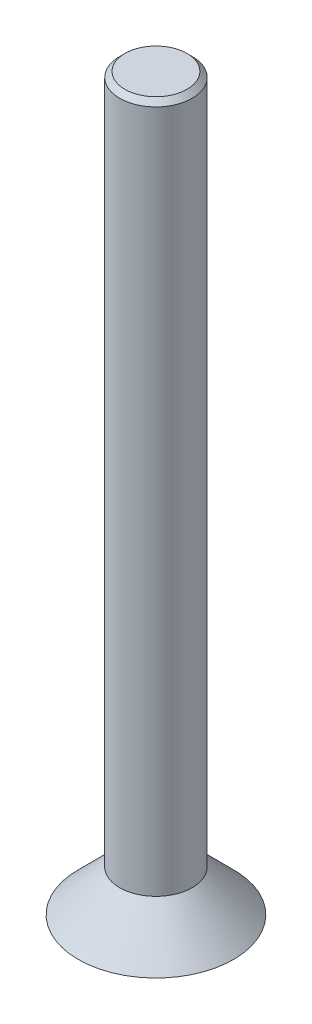
ISO-10303-21;
HEADER;
FILE_DESCRIPTION(('STEP AP214'),'2;1');
FILE_NAME('part.step','',(''),(''),'','','');
FILE_SCHEMA(('AUTOMOTIVE_DESIGN { 1 0 10303 214 1 1 1 1 }'));
ENDSEC;
DATA;
#1=APPLICATION_CONTEXT('core data for automotive mechanical design processes');
#2=APPLICATION_PROTOCOL_DEFINITION('international standard','automotive_design',2000,#1);
#3=PRODUCT_CONTEXT('',#1,'mechanical');
#4=PRODUCT('Part','Part','',(#3));
#5=PRODUCT_RELATED_PRODUCT_CATEGORY('part','',(#4));
#6=PRODUCT_DEFINITION_FORMATION('','',#4);
#7=PRODUCT_DEFINITION_CONTEXT('part definition',#1,'design');
#8=PRODUCT_DEFINITION('design','',#6,#7);
#9=PRODUCT_DEFINITION_SHAPE('','',#8);
#10=(LENGTH_UNIT() NAMED_UNIT(*) SI_UNIT(.MILLI.,.METRE.));
#11=(NAMED_UNIT(*) PLANE_ANGLE_UNIT() SI_UNIT($,.RADIAN.));
#12=(NAMED_UNIT(*) SI_UNIT($,.STERADIAN.) SOLID_ANGLE_UNIT());
#13=UNCERTAINTY_MEASURE_WITH_UNIT(LENGTH_MEASURE(1.E-05),#10,'distance_accuracy_value','');
#14=(GEOMETRIC_REPRESENTATION_CONTEXT(3) GLOBAL_UNCERTAINTY_ASSIGNED_CONTEXT((#13)) GLOBAL_UNIT_ASSIGNED_CONTEXT((#10,
#11,#12)) REPRESENTATION_CONTEXT('',''));
#15=CARTESIAN_POINT('',(0.,0.,0.));
#16=DIRECTION('',(0.,0.,1.));
#17=DIRECTION('',(1.,0.,0.));
#18=AXIS2_PLACEMENT_3D('',#15,#16,#17);
#19=CARTESIAN_POINT('',(0.,0.,0.));
#20=DIRECTION('',(0.,1.,0.));
#21=DIRECTION('',(0.,0.,1.));
#22=AXIS2_PLACEMENT_3D('',#19,#20,#21);
#23=PLANE('',#22);
#24=CARTESIAN_POINT('',(0.,0.,0.));
#25=DIRECTION('',(0.,1.,0.));
#26=DIRECTION('',(0.,0.,1.));
#27=AXIS2_PLACEMENT_3D('',#24,#25,#26);
#28=CIRCLE('',#27,3.);
#29=CARTESIAN_POINT('',(0.,0.,3.));
#30=VERTEX_POINT('',#29);
#31=EDGE_CURVE('E128',#30,#30,#28,.T.);
#32=ORIENTED_EDGE('',*,*,#31,.F.);
#33=EDGE_LOOP('',(#32));
#34=FACE_BOUND('',#33,.T.);
#35=DIRECTION('',(0.866025403784439,0.,0.5));
#36=VECTOR('',#35,1.);
#37=CARTESIAN_POINT('',(-1.,0.,0.577350269189626));
#38=LINE('',#37,#36);
#39=CARTESIAN_POINT('',(-1.,0.,0.577350269189626));
#40=VERTEX_POINT('',#39);
#41=CARTESIAN_POINT('',(0.,0.,1.15470053837925));
#42=VERTEX_POINT('',#41);
#43=EDGE_CURVE('E57',#40,#42,#38,.T.);
#44=ORIENTED_EDGE('',*,*,#43,.T.);
#45=DIRECTION('',(0.866025403784438,0.,-0.5));
#46=VECTOR('',#45,1.);
#47=CARTESIAN_POINT('',(0.,0.,1.15470053837925));
#48=LINE('',#47,#46);
#49=CARTESIAN_POINT('',(1.,0.,0.577350269189626));
#50=VERTEX_POINT('',#49);
#51=EDGE_CURVE('E113',#42,#50,#48,.T.);
#52=ORIENTED_EDGE('',*,*,#51,.T.);
#53=DIRECTION('',(0.,0.,-1.));
#54=VECTOR('',#53,1.);
#55=CARTESIAN_POINT('',(1.,0.,0.577350269189626));
#56=LINE('',#55,#54);
#57=CARTESIAN_POINT('',(0.999999999999999,0.,-0.577350269189626));
#58=VERTEX_POINT('',#57);
#59=EDGE_CURVE('E111',#50,#58,#56,.T.);
#60=ORIENTED_EDGE('',*,*,#59,.T.);
#61=DIRECTION('',(-0.866025403784439,0.,-0.5));
#62=VECTOR('',#61,1.);
#63=CARTESIAN_POINT('',(0.999999999999999,0.,-0.577350269189626));
#64=LINE('',#63,#62);
#65=CARTESIAN_POINT('',(0.,0.,-1.15470053837925));
#66=VERTEX_POINT('',#65);
#67=EDGE_CURVE('E92',#58,#66,#64,.T.);
#68=ORIENTED_EDGE('',*,*,#67,.T.);
#69=DIRECTION('',(-0.866025403784438,0.,0.5));
#70=VECTOR('',#69,1.);
#71=CARTESIAN_POINT('',(0.,0.,-1.15470053837925));
#72=LINE('',#71,#70);
#73=CARTESIAN_POINT('',(-1.,0.,-0.577350269189625));
#74=VERTEX_POINT('',#73);
#75=EDGE_CURVE('E101',#66,#74,#72,.T.);
#76=ORIENTED_EDGE('',*,*,#75,.T.);
#77=DIRECTION('',(0.,0.,1.));
#78=VECTOR('',#77,1.);
#79=CARTESIAN_POINT('',(-1.,0.,-0.577350269189625));
#80=LINE('',#79,#78);
#81=EDGE_CURVE('E107',#74,#40,#80,.T.);
#82=ORIENTED_EDGE('',*,*,#81,.T.);
#83=EDGE_LOOP('',(#44,#52,#60,#68,#76,#82));
#84=FACE_BOUND('',#83,.T.);
#85=ADVANCED_FACE('F41',(#34,#84),#23,.F.);
#86=CARTESIAN_POINT('',(-1.,1.6,0.577350269189626));
#87=DIRECTION('',(0.5,0.,-0.866025403784439));
#88=DIRECTION('',(-0.866025403784439,0.,-0.5));
#89=AXIS2_PLACEMENT_3D('',#86,#87,#88);
#90=PLANE('',#89);
#91=ORIENTED_EDGE('',*,*,#43,.F.);
#92=DIRECTION('',(0.,-1.,0.));
#93=VECTOR('',#92,1.);
#94=CARTESIAN_POINT('',(-1.,1.6,0.577350269189626));
#95=LINE('',#94,#93);
#96=CARTESIAN_POINT('',(-1.,1.6,0.577350269189626));
#97=VERTEX_POINT('',#96);
#98=EDGE_CURVE('E119',#97,#40,#95,.T.);
#99=ORIENTED_EDGE('',*,*,#98,.F.);
#100=DIRECTION('',(0.866025403784439,0.,0.5));
#101=VECTOR('',#100,1.);
#102=CARTESIAN_POINT('',(-1.,1.6,0.577350269189626));
#103=LINE('',#102,#101);
#104=CARTESIAN_POINT('',(0.,1.6,1.15470053837925));
#105=VERTEX_POINT('',#104);
#106=EDGE_CURVE('E118',#97,#105,#103,.T.);
#107=ORIENTED_EDGE('',*,*,#106,.T.);
#108=DIRECTION('',(0.,-1.,0.));
#109=VECTOR('',#108,1.);
#110=CARTESIAN_POINT('',(0.,1.6,1.15470053837925));
#111=LINE('',#110,#109);
#112=EDGE_CURVE('E126',#105,#42,#111,.T.);
#113=ORIENTED_EDGE('',*,*,#112,.T.);
#114=EDGE_LOOP('',(#91,#99,#107,#113));
#115=FACE_BOUND('',#114,.T.);
#116=ADVANCED_FACE('F147',(#115),#90,.T.);
#117=CARTESIAN_POINT('',(0.,1.6,1.15470053837925));
#118=DIRECTION('',(-0.5,0.,-0.866025403784438));
#119=DIRECTION('',(-0.866025403784439,0.,0.5));
#120=AXIS2_PLACEMENT_3D('',#117,#118,#119);
#121=PLANE('',#120);
#122=ORIENTED_EDGE('',*,*,#51,.F.);
#123=ORIENTED_EDGE('',*,*,#112,.F.);
#124=DIRECTION('',(0.866025403784438,0.,-0.5));
#125=VECTOR('',#124,1.);
#126=CARTESIAN_POINT('',(0.,1.6,1.15470053837925));
#127=LINE('',#126,#125);
#128=CARTESIAN_POINT('',(1.,1.6,0.577350269189626));
#129=VERTEX_POINT('',#128);
#130=EDGE_CURVE('E206',#105,#129,#127,.T.);
#131=ORIENTED_EDGE('',*,*,#130,.T.);
#132=DIRECTION('',(0.,-1.,0.));
#133=VECTOR('',#132,1.);
#134=CARTESIAN_POINT('',(1.,1.6,0.577350269189626));
#135=LINE('',#134,#133);
#136=EDGE_CURVE('E124',#129,#50,#135,.T.);
#137=ORIENTED_EDGE('',*,*,#136,.T.);
#138=EDGE_LOOP('',(#122,#123,#131,#137));
#139=FACE_BOUND('',#138,.T.);
#140=ADVANCED_FACE('F153',(#139),#121,.T.);
#141=CARTESIAN_POINT('',(1.,1.6,0.577350269189626));
#142=DIRECTION('',(-1.,0.,0.));
#143=DIRECTION('',(0.,0.,1.));
#144=AXIS2_PLACEMENT_3D('',#141,#142,#143);
#145=PLANE('',#144);
#146=ORIENTED_EDGE('',*,*,#59,.F.);
#147=ORIENTED_EDGE('',*,*,#136,.F.);
#148=DIRECTION('',(0.,0.,-1.));
#149=VECTOR('',#148,1.);
#150=CARTESIAN_POINT('',(1.,1.6,0.577350269189626));
#151=LINE('',#150,#149);
#152=CARTESIAN_POINT('',(0.999999999999999,1.6,-0.577350269189626));
#153=VERTEX_POINT('',#152);
#154=EDGE_CURVE('E204',#129,#153,#151,.T.);
#155=ORIENTED_EDGE('',*,*,#154,.T.);
#156=DIRECTION('',(0.,-1.,0.));
#157=VECTOR('',#156,1.);
#158=CARTESIAN_POINT('',(0.999999999999999,1.6,-0.577350269189626));
#159=LINE('',#158,#157);
#160=EDGE_CURVE('E97',#153,#58,#159,.T.);
#161=ORIENTED_EDGE('',*,*,#160,.T.);
#162=EDGE_LOOP('',(#146,#147,#155,#161));
#163=FACE_BOUND('',#162,.T.);
#164=ADVANCED_FACE('F185',(#163),#145,.T.);
#165=CARTESIAN_POINT('',(0.999999999999999,1.6,-0.577350269189626));
#166=DIRECTION('',(-0.5,0.,0.866025403784439));
#167=DIRECTION('',(0.866025403784439,0.,0.5));
#168=AXIS2_PLACEMENT_3D('',#165,#166,#167);
#169=PLANE('',#168);
#170=ORIENTED_EDGE('',*,*,#67,.F.);
#171=ORIENTED_EDGE('',*,*,#160,.F.);
#172=DIRECTION('',(-0.866025403784439,0.,-0.5));
#173=VECTOR('',#172,1.);
#174=CARTESIAN_POINT('',(0.999999999999999,1.6,-0.577350269189626));
#175=LINE('',#174,#173);
#176=CARTESIAN_POINT('',(0.,1.6,-1.15470053837925));
#177=VERTEX_POINT('',#176);
#178=EDGE_CURVE('E66',#153,#177,#175,.T.);
#179=ORIENTED_EDGE('',*,*,#178,.T.);
#180=DIRECTION('',(0.,-1.,0.));
#181=VECTOR('',#180,1.);
#182=CARTESIAN_POINT('',(0.,1.6,-1.15470053837925));
#183=LINE('',#182,#181);
#184=EDGE_CURVE('E87',#177,#66,#183,.T.);
#185=ORIENTED_EDGE('',*,*,#184,.T.);
#186=EDGE_LOOP('',(#170,#171,#179,#185));
#187=FACE_BOUND('',#186,.T.);
#188=ADVANCED_FACE('F89',(#187),#169,.T.);
#189=CARTESIAN_POINT('',(0.,1.6,-1.15470053837925));
#190=DIRECTION('',(0.5,0.,0.866025403784438));
#191=DIRECTION('',(0.866025403784439,0.,-0.5));
#192=AXIS2_PLACEMENT_3D('',#189,#190,#191);
#193=PLANE('',#192);
#194=ORIENTED_EDGE('',*,*,#75,.F.);
#195=ORIENTED_EDGE('',*,*,#184,.F.);
#196=DIRECTION('',(-0.866025403784438,0.,0.5));
#197=VECTOR('',#196,1.);
#198=CARTESIAN_POINT('',(0.,1.6,-1.15470053837925));
#199=LINE('',#198,#197);
#200=CARTESIAN_POINT('',(-1.,1.6,-0.577350269189625));
#201=VERTEX_POINT('',#200);
#202=EDGE_CURVE('E201',#177,#201,#199,.T.);
#203=ORIENTED_EDGE('',*,*,#202,.T.);
#204=DIRECTION('',(0.,-1.,0.));
#205=VECTOR('',#204,1.);
#206=CARTESIAN_POINT('',(-1.,1.6,-0.577350269189625));
#207=LINE('',#206,#205);
#208=EDGE_CURVE('E98',#201,#74,#207,.T.);
#209=ORIENTED_EDGE('',*,*,#208,.T.);
#210=EDGE_LOOP('',(#194,#195,#203,#209));
#211=FACE_BOUND('',#210,.T.);
#212=ADVANCED_FACE('F102',(#211),#193,.T.);
#213=CARTESIAN_POINT('',(-1.,1.6,-0.577350269189625));
#214=DIRECTION('',(1.,0.,0.));
#215=DIRECTION('',(0.,0.,-1.));
#216=AXIS2_PLACEMENT_3D('',#213,#214,#215);
#217=PLANE('',#216);
#218=ORIENTED_EDGE('',*,*,#81,.F.);
#219=ORIENTED_EDGE('',*,*,#208,.F.);
#220=DIRECTION('',(0.,0.,1.));
#221=VECTOR('',#220,1.);
#222=CARTESIAN_POINT('',(-1.,1.6,-0.577350269189625));
#223=LINE('',#222,#221);
#224=EDGE_CURVE('E121',#201,#97,#223,.T.);
#225=ORIENTED_EDGE('',*,*,#224,.T.);
#226=ORIENTED_EDGE('',*,*,#98,.T.);
#227=EDGE_LOOP('',(#218,#219,#225,#226));
#228=FACE_BOUND('',#227,.T.);
#229=ADVANCED_FACE('F163',(#228),#217,.T.);
#230=CARTESIAN_POINT('',(0.,1.6,0.));
#231=DIRECTION('',(0.,-1.,0.));
#232=DIRECTION('',(0.,0.,-1.));
#233=AXIS2_PLACEMENT_3D('',#230,#231,#232);
#234=CONICAL_SURFACE('',#233,1.4,0.785398163397447);
#235=ORIENTED_EDGE('',*,*,#31,.T.);
#236=EDGE_LOOP('',(#235));
#237=FACE_BOUND('',#236,.T.);
#238=CARTESIAN_POINT('',(0.,1.6,0.));
#239=DIRECTION('',(0.,1.,0.));
#240=DIRECTION('',(0.,0.,1.));
#241=AXIS2_PLACEMENT_3D('',#238,#239,#240);
#242=CIRCLE('',#241,1.4);
#243=CARTESIAN_POINT('',(0.,1.6,1.4));
#244=VERTEX_POINT('',#243);
#245=EDGE_CURVE('E131',#244,#244,#242,.T.);
#246=ORIENTED_EDGE('',*,*,#245,.F.);
#247=EDGE_LOOP('',(#246));
#248=FACE_BOUND('',#247,.T.);
#249=ADVANCED_FACE('F158',(#237,#248),#234,.T.);
#250=CARTESIAN_POINT('',(0.,1.6,0.));
#251=DIRECTION('',(0.,1.,0.));
#252=DIRECTION('',(0.,0.,1.));
#253=AXIS2_PLACEMENT_3D('',#250,#251,#252);
#254=PLANE('',#253);
#255=ORIENTED_EDGE('',*,*,#130,.F.);
#256=ORIENTED_EDGE('',*,*,#106,.F.);
#257=ORIENTED_EDGE('',*,*,#224,.F.);
#258=ORIENTED_EDGE('',*,*,#202,.F.);
#259=ORIENTED_EDGE('',*,*,#178,.F.);
#260=ORIENTED_EDGE('',*,*,#154,.F.);
#261=EDGE_LOOP('',(#255,#256,#257,#258,#259,#260));
#262=FACE_BOUND('',#261,.T.);
#263=ADVANCED_FACE('F162',(#262),#254,.F.);
#264=CARTESIAN_POINT('',(0.,28.2,0.));
#265=DIRECTION('',(0.,-1.,0.));
#266=DIRECTION('',(0.,0.,-1.));
#267=AXIS2_PLACEMENT_3D('',#264,#265,#266);
#268=CYLINDRICAL_SURFACE('',#267,1.4);
#269=CARTESIAN_POINT('',(0.,28.,0.));
#270=DIRECTION('',(0.,1.,0.));
#271=DIRECTION('',(0.,0.,1.));
#272=AXIS2_PLACEMENT_3D('',#269,#270,#271);
#273=CIRCLE('',#272,1.4);
#274=CARTESIAN_POINT('',(0.,28.,1.4));
#275=VERTEX_POINT('',#274);
#276=EDGE_CURVE('E11',#275,#275,#273,.F.);
#277=ORIENTED_EDGE('',*,*,#276,.T.);
#278=EDGE_LOOP('',(#277));
#279=FACE_BOUND('',#278,.T.);
#280=ORIENTED_EDGE('',*,*,#245,.T.);
#281=EDGE_LOOP('',(#280));
#282=FACE_BOUND('',#281,.T.);
#283=ADVANCED_FACE('F143',(#279,#282),#268,.T.);
#284=CARTESIAN_POINT('',(0.,28.2,0.));
#285=DIRECTION('',(0.,1.,0.));
#286=DIRECTION('',(0.,0.,1.));
#287=AXIS2_PLACEMENT_3D('',#284,#285,#286);
#288=PLANE('',#287);
#289=CARTESIAN_POINT('',(0.,28.2,0.));
#290=DIRECTION('',(0.,1.,0.));
#291=DIRECTION('',(0.,0.,1.));
#292=AXIS2_PLACEMENT_3D('',#289,#290,#291);
#293=CIRCLE('',#292,1.20000000000001);
#294=CARTESIAN_POINT('',(0.,28.2,1.20000000000001));
#295=VERTEX_POINT('',#294);
#296=EDGE_CURVE('E50',#295,#295,#293,.T.);
#297=ORIENTED_EDGE('',*,*,#296,.T.);
#298=EDGE_LOOP('',(#297));
#299=FACE_BOUND('',#298,.T.);
#300=ADVANCED_FACE('F136',(#299),#288,.T.);
#301=CARTESIAN_POINT('',(0.,28.2,0.));
#302=DIRECTION('',(0.,-1.,0.));
#303=DIRECTION('',(0.,0.,-1.));
#304=AXIS2_PLACEMENT_3D('',#301,#302,#303);
#305=CONICAL_SURFACE('',#304,1.20000000000001,0.785398163397453);
#306=ORIENTED_EDGE('',*,*,#276,.F.);
#307=EDGE_LOOP('',(#306));
#308=FACE_BOUND('',#307,.T.);
#309=ORIENTED_EDGE('',*,*,#296,.F.);
#310=EDGE_LOOP('',(#309));
#311=FACE_BOUND('',#310,.T.);
#312=ADVANCED_FACE('F44',(#308,#311),#305,.T.);
#313=CLOSED_SHELL('',(#85,#116,#140,#164,#188,#212,#229,#249,#263,#283,#300,#312));
#314=MANIFOLD_SOLID_BREP('B2',#313);
#315=ADVANCED_BREP_SHAPE_REPRESENTATION('',(#18,#314),#14);
#316=SHAPE_DEFINITION_REPRESENTATION(#9,#315);
ENDSEC;
END-ISO-10303-21;
